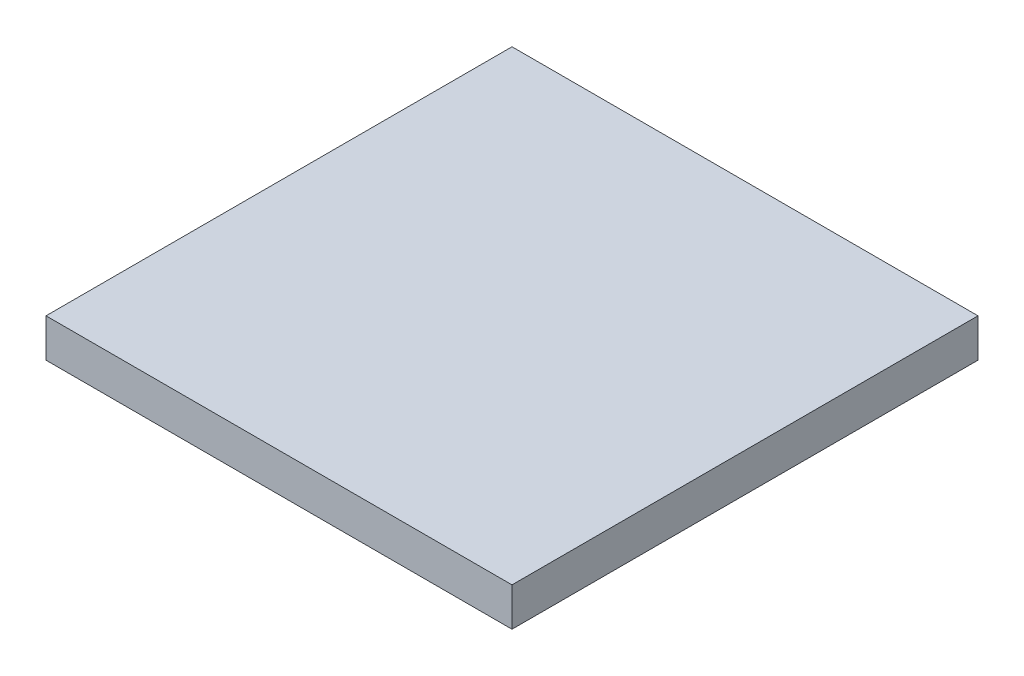
ISO-10303-21;
HEADER;
FILE_DESCRIPTION(('STEP AP214'),'2;1');
FILE_NAME('part.step','',(''),(''),'','','');
FILE_SCHEMA(('AUTOMOTIVE_DESIGN { 1 0 10303 214 1 1 1 1 }'));
ENDSEC;
DATA;
#1=APPLICATION_CONTEXT('core data for automotive mechanical design processes');
#2=APPLICATION_PROTOCOL_DEFINITION('international standard','automotive_design',2000,#1);
#3=PRODUCT_CONTEXT('',#1,'mechanical');
#4=PRODUCT('Part','Part','',(#3));
#5=PRODUCT_RELATED_PRODUCT_CATEGORY('part','',(#4));
#6=PRODUCT_DEFINITION_FORMATION('','',#4);
#7=PRODUCT_DEFINITION_CONTEXT('part definition',#1,'design');
#8=PRODUCT_DEFINITION('design','',#6,#7);
#9=PRODUCT_DEFINITION_SHAPE('','',#8);
#10=(LENGTH_UNIT() NAMED_UNIT(*) SI_UNIT(.MILLI.,.METRE.));
#11=(NAMED_UNIT(*) PLANE_ANGLE_UNIT() SI_UNIT($,.RADIAN.));
#12=(NAMED_UNIT(*) SI_UNIT($,.STERADIAN.) SOLID_ANGLE_UNIT());
#13=UNCERTAINTY_MEASURE_WITH_UNIT(LENGTH_MEASURE(1.E-05),#10,'distance_accuracy_value','');
#14=(GEOMETRIC_REPRESENTATION_CONTEXT(3) GLOBAL_UNCERTAINTY_ASSIGNED_CONTEXT((#13)) GLOBAL_UNIT_ASSIGNED_CONTEXT((#10,
#11,#12)) REPRESENTATION_CONTEXT('',''));
#15=CARTESIAN_POINT('',(0.,0.,0.));
#16=DIRECTION('',(0.,0.,1.));
#17=DIRECTION('',(1.,0.,0.));
#18=AXIS2_PLACEMENT_3D('',#15,#16,#17);
#19=CARTESIAN_POINT('',(20.,3.3,20.));
#20=DIRECTION('',(-1.,0.,0.));
#21=DIRECTION('',(0.,0.,1.));
#22=AXIS2_PLACEMENT_3D('',#19,#20,#21);
#23=PLANE('',#22);
#24=DIRECTION('',(0.,0.,-1.));
#25=VECTOR('',#24,1.);
#26=CARTESIAN_POINT('',(20.,0.,20.));
#27=LINE('',#26,#25);
#28=CARTESIAN_POINT('',(20.,0.,20.));
#29=VERTEX_POINT('',#28);
#30=CARTESIAN_POINT('',(20.,0.,-20.));
#31=VERTEX_POINT('',#30);
#32=EDGE_CURVE('E113',#29,#31,#27,.T.);
#33=ORIENTED_EDGE('',*,*,#32,.T.);
#34=DIRECTION('',(0.,-1.,0.));
#35=VECTOR('',#34,1.);
#36=CARTESIAN_POINT('',(20.,3.3,-20.));
#37=LINE('',#36,#35);
#38=CARTESIAN_POINT('',(20.,3.3,-20.));
#39=VERTEX_POINT('',#38);
#40=EDGE_CURVE('E11',#39,#31,#37,.T.);
#41=ORIENTED_EDGE('',*,*,#40,.F.);
#42=DIRECTION('',(0.,0.,-1.));
#43=VECTOR('',#42,1.);
#44=CARTESIAN_POINT('',(20.,3.3,20.));
#45=LINE('',#44,#43);
#46=CARTESIAN_POINT('',(20.,3.3,20.));
#47=VERTEX_POINT('',#46);
#48=EDGE_CURVE('E97',#47,#39,#45,.T.);
#49=ORIENTED_EDGE('',*,*,#48,.F.);
#50=DIRECTION('',(0.,-1.,0.));
#51=VECTOR('',#50,1.);
#52=CARTESIAN_POINT('',(20.,3.3,20.));
#53=LINE('',#52,#51);
#54=EDGE_CURVE('E109',#47,#29,#53,.T.);
#55=ORIENTED_EDGE('',*,*,#54,.T.);
#56=EDGE_LOOP('',(#33,#41,#49,#55));
#57=FACE_BOUND('',#56,.T.);
#58=ADVANCED_FACE('F45',(#57),#23,.F.);
#59=CARTESIAN_POINT('',(-20.,3.3,-20.));
#60=DIRECTION('',(0.,0.,1.));
#61=DIRECTION('',(1.,0.,0.));
#62=AXIS2_PLACEMENT_3D('',#59,#60,#61);
#63=PLANE('',#62);
#64=DIRECTION('',(-1.,0.,0.));
#65=VECTOR('',#64,1.);
#66=CARTESIAN_POINT('',(-20.,0.,-20.));
#67=LINE('',#66,#65);
#68=CARTESIAN_POINT('',(-20.,0.,-20.));
#69=VERTEX_POINT('',#68);
#70=EDGE_CURVE('E102',#31,#69,#67,.T.);
#71=ORIENTED_EDGE('',*,*,#70,.T.);
#72=DIRECTION('',(0.,-1.,0.));
#73=VECTOR('',#72,1.);
#74=CARTESIAN_POINT('',(-20.,3.3,-20.));
#75=LINE('',#74,#73);
#76=CARTESIAN_POINT('',(-20.,3.3,-20.));
#77=VERTEX_POINT('',#76);
#78=EDGE_CURVE('E54',#77,#69,#75,.T.);
#79=ORIENTED_EDGE('',*,*,#78,.F.);
#80=DIRECTION('',(-1.,0.,0.));
#81=VECTOR('',#80,1.);
#82=CARTESIAN_POINT('',(-20.,3.3,-20.));
#83=LINE('',#82,#81);
#84=EDGE_CURVE('E92',#39,#77,#83,.T.);
#85=ORIENTED_EDGE('',*,*,#84,.F.);
#86=ORIENTED_EDGE('',*,*,#40,.T.);
#87=EDGE_LOOP('',(#71,#79,#85,#86));
#88=FACE_BOUND('',#87,.T.);
#89=ADVANCED_FACE('F101',(#88),#63,.F.);
#90=CARTESIAN_POINT('',(-20.,3.3,20.));
#91=DIRECTION('',(1.,0.,0.));
#92=DIRECTION('',(0.,0.,-1.));
#93=AXIS2_PLACEMENT_3D('',#90,#91,#92);
#94=PLANE('',#93);
#95=DIRECTION('',(0.,0.,1.));
#96=VECTOR('',#95,1.);
#97=CARTESIAN_POINT('',(-20.,0.,20.));
#98=LINE('',#97,#96);
#99=CARTESIAN_POINT('',(-20.,0.,20.));
#100=VERTEX_POINT('',#99);
#101=EDGE_CURVE('E79',#69,#100,#98,.T.);
#102=ORIENTED_EDGE('',*,*,#101,.T.);
#103=DIRECTION('',(0.,-1.,0.));
#104=VECTOR('',#103,1.);
#105=CARTESIAN_POINT('',(-20.,3.3,20.));
#106=LINE('',#105,#104);
#107=CARTESIAN_POINT('',(-20.,3.3,20.));
#108=VERTEX_POINT('',#107);
#109=EDGE_CURVE('E104',#108,#100,#106,.T.);
#110=ORIENTED_EDGE('',*,*,#109,.F.);
#111=DIRECTION('',(0.,0.,1.));
#112=VECTOR('',#111,1.);
#113=CARTESIAN_POINT('',(-20.,3.3,20.));
#114=LINE('',#113,#112);
#115=EDGE_CURVE('E95',#77,#108,#114,.T.);
#116=ORIENTED_EDGE('',*,*,#115,.F.);
#117=ORIENTED_EDGE('',*,*,#78,.T.);
#118=EDGE_LOOP('',(#102,#110,#116,#117));
#119=FACE_BOUND('',#118,.T.);
#120=ADVANCED_FACE('F105',(#119),#94,.F.);
#121=CARTESIAN_POINT('',(-20.,3.3,20.));
#122=DIRECTION('',(0.,0.,-1.));
#123=DIRECTION('',(-1.,0.,0.));
#124=AXIS2_PLACEMENT_3D('',#121,#122,#123);
#125=PLANE('',#124);
#126=DIRECTION('',(1.,0.,0.));
#127=VECTOR('',#126,1.);
#128=CARTESIAN_POINT('',(-20.,0.,20.));
#129=LINE('',#128,#127);
#130=EDGE_CURVE('E85',#100,#29,#129,.T.);
#131=ORIENTED_EDGE('',*,*,#130,.T.);
#132=ORIENTED_EDGE('',*,*,#54,.F.);
#133=DIRECTION('',(1.,0.,0.));
#134=VECTOR('',#133,1.);
#135=CARTESIAN_POINT('',(-20.,3.3,20.));
#136=LINE('',#135,#134);
#137=EDGE_CURVE('E62',#108,#47,#136,.T.);
#138=ORIENTED_EDGE('',*,*,#137,.F.);
#139=ORIENTED_EDGE('',*,*,#109,.T.);
#140=EDGE_LOOP('',(#131,#132,#138,#139));
#141=FACE_BOUND('',#140,.T.);
#142=ADVANCED_FACE('F126',(#141),#125,.F.);
#143=CARTESIAN_POINT('',(0.,3.3,0.));
#144=DIRECTION('',(0.,-1.,0.));
#145=DIRECTION('',(0.,0.,-1.));
#146=AXIS2_PLACEMENT_3D('',#143,#144,#145);
#147=PLANE('',#146);
#148=ORIENTED_EDGE('',*,*,#48,.T.);
#149=ORIENTED_EDGE('',*,*,#84,.T.);
#150=ORIENTED_EDGE('',*,*,#115,.T.);
#151=ORIENTED_EDGE('',*,*,#137,.T.);
#152=EDGE_LOOP('',(#148,#149,#150,#151));
#153=FACE_BOUND('',#152,.T.);
#154=ADVANCED_FACE('F93',(#153),#147,.F.);
#155=CARTESIAN_POINT('',(0.,0.,0.));
#156=DIRECTION('',(0.,-1.,0.));
#157=DIRECTION('',(0.,0.,-1.));
#158=AXIS2_PLACEMENT_3D('',#155,#156,#157);
#159=PLANE('',#158);
#160=ORIENTED_EDGE('',*,*,#32,.F.);
#161=ORIENTED_EDGE('',*,*,#130,.F.);
#162=ORIENTED_EDGE('',*,*,#101,.F.);
#163=ORIENTED_EDGE('',*,*,#70,.F.);
#164=EDGE_LOOP('',(#160,#161,#162,#163));
#165=FACE_BOUND('',#164,.T.);
#166=ADVANCED_FACE('F129',(#165),#159,.T.);
#167=CLOSED_SHELL('',(#58,#89,#120,#142,#154,#166));
#168=MANIFOLD_SOLID_BREP('B2',#167);
#169=ADVANCED_BREP_SHAPE_REPRESENTATION('',(#18,#168),#14);
#170=SHAPE_DEFINITION_REPRESENTATION(#9,#169);
ENDSEC;
END-ISO-10303-21;
